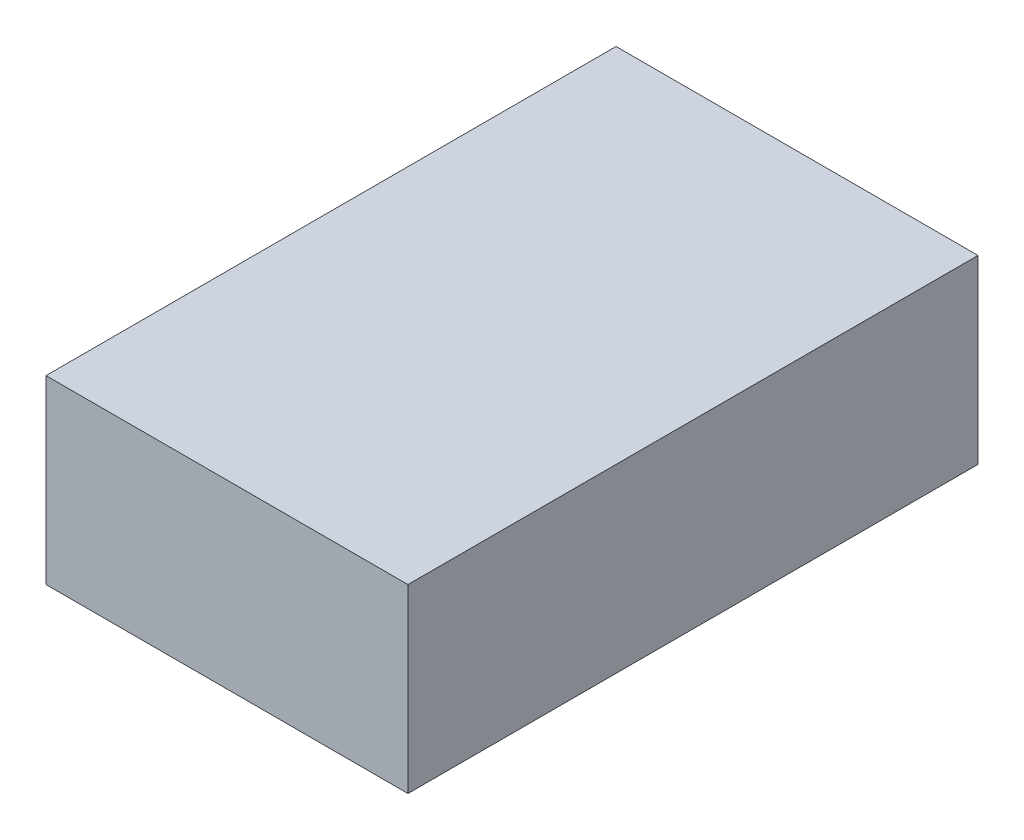
ISO-10303-21;
HEADER;
FILE_DESCRIPTION(('STEP AP214'),'2;1');
FILE_NAME('part.step','',(''),(''),'','','');
FILE_SCHEMA(('AUTOMOTIVE_DESIGN { 1 0 10303 214 1 1 1 1 }'));
ENDSEC;
DATA;
#1=APPLICATION_CONTEXT('core data for automotive mechanical design processes');
#2=APPLICATION_PROTOCOL_DEFINITION('international standard','automotive_design',2000,#1);
#3=PRODUCT_CONTEXT('',#1,'mechanical');
#4=PRODUCT('Part','Part','',(#3));
#5=PRODUCT_RELATED_PRODUCT_CATEGORY('part','',(#4));
#6=PRODUCT_DEFINITION_FORMATION('','',#4);
#7=PRODUCT_DEFINITION_CONTEXT('part definition',#1,'design');
#8=PRODUCT_DEFINITION('design','',#6,#7);
#9=PRODUCT_DEFINITION_SHAPE('','',#8);
#10=(LENGTH_UNIT() NAMED_UNIT(*) SI_UNIT(.MILLI.,.METRE.));
#11=(NAMED_UNIT(*) PLANE_ANGLE_UNIT() SI_UNIT($,.RADIAN.));
#12=(NAMED_UNIT(*) SI_UNIT($,.STERADIAN.) SOLID_ANGLE_UNIT());
#13=UNCERTAINTY_MEASURE_WITH_UNIT(LENGTH_MEASURE(1.E-05),#10,'distance_accuracy_value','');
#14=(GEOMETRIC_REPRESENTATION_CONTEXT(3) GLOBAL_UNCERTAINTY_ASSIGNED_CONTEXT((#13)) GLOBAL_UNIT_ASSIGNED_CONTEXT((#10,
#11,#12)) REPRESENTATION_CONTEXT('',''));
#15=CARTESIAN_POINT('',(0.,0.,0.));
#16=DIRECTION('',(0.,0.,1.));
#17=DIRECTION('',(1.,0.,0.));
#18=AXIS2_PLACEMENT_3D('',#15,#16,#17);
#19=CARTESIAN_POINT('',(0.,20.,63.));
#20=DIRECTION('',(1.,0.,0.));
#21=DIRECTION('',(0.,0.,-1.));
#22=AXIS2_PLACEMENT_3D('',#19,#20,#21);
#23=PLANE('',#22);
#24=DIRECTION('',(0.,0.,1.));
#25=VECTOR('',#24,1.);
#26=CARTESIAN_POINT('',(0.,0.,63.));
#27=LINE('',#26,#25);
#28=CARTESIAN_POINT('',(0.,0.,0.));
#29=VERTEX_POINT('',#28);
#30=CARTESIAN_POINT('',(0.,0.,63.));
#31=VERTEX_POINT('',#30);
#32=EDGE_CURVE('E107',#29,#31,#27,.T.);
#33=ORIENTED_EDGE('',*,*,#32,.T.);
#34=DIRECTION('',(0.,-1.,0.));
#35=VECTOR('',#34,1.);
#36=CARTESIAN_POINT('',(0.,20.,63.));
#37=LINE('',#36,#35);
#38=CARTESIAN_POINT('',(0.,20.,63.));
#39=VERTEX_POINT('',#38);
#40=EDGE_CURVE('E11',#39,#31,#37,.T.);
#41=ORIENTED_EDGE('',*,*,#40,.F.);
#42=DIRECTION('',(0.,0.,1.));
#43=VECTOR('',#42,1.);
#44=CARTESIAN_POINT('',(0.,20.,63.));
#45=LINE('',#44,#43);
#46=CARTESIAN_POINT('',(0.,20.,0.));
#47=VERTEX_POINT('',#46);
#48=EDGE_CURVE('E91',#47,#39,#45,.T.);
#49=ORIENTED_EDGE('',*,*,#48,.F.);
#50=DIRECTION('',(0.,-1.,0.));
#51=VECTOR('',#50,1.);
#52=CARTESIAN_POINT('',(0.,20.,0.));
#53=LINE('',#52,#51);
#54=EDGE_CURVE('E103',#47,#29,#53,.T.);
#55=ORIENTED_EDGE('',*,*,#54,.T.);
#56=EDGE_LOOP('',(#33,#41,#49,#55));
#57=FACE_BOUND('',#56,.T.);
#58=ADVANCED_FACE('F39',(#57),#23,.F.);
#59=CARTESIAN_POINT('',(40.,20.,63.));
#60=DIRECTION('',(0.,0.,-1.));
#61=DIRECTION('',(-1.,0.,0.));
#62=AXIS2_PLACEMENT_3D('',#59,#60,#61);
#63=PLANE('',#62);
#64=DIRECTION('',(1.,0.,0.));
#65=VECTOR('',#64,1.);
#66=CARTESIAN_POINT('',(40.,0.,63.));
#67=LINE('',#66,#65);
#68=CARTESIAN_POINT('',(40.,0.,63.));
#69=VERTEX_POINT('',#68);
#70=EDGE_CURVE('E96',#31,#69,#67,.T.);
#71=ORIENTED_EDGE('',*,*,#70,.T.);
#72=DIRECTION('',(0.,-1.,0.));
#73=VECTOR('',#72,1.);
#74=CARTESIAN_POINT('',(40.,20.,63.));
#75=LINE('',#74,#73);
#76=CARTESIAN_POINT('',(40.,20.,63.));
#77=VERTEX_POINT('',#76);
#78=EDGE_CURVE('E48',#77,#69,#75,.T.);
#79=ORIENTED_EDGE('',*,*,#78,.F.);
#80=DIRECTION('',(1.,0.,0.));
#81=VECTOR('',#80,1.);
#82=CARTESIAN_POINT('',(40.,20.,63.));
#83=LINE('',#82,#81);
#84=EDGE_CURVE('E86',#39,#77,#83,.T.);
#85=ORIENTED_EDGE('',*,*,#84,.F.);
#86=ORIENTED_EDGE('',*,*,#40,.T.);
#87=EDGE_LOOP('',(#71,#79,#85,#86));
#88=FACE_BOUND('',#87,.T.);
#89=ADVANCED_FACE('F95',(#88),#63,.F.);
#90=CARTESIAN_POINT('',(40.,20.,0.));
#91=DIRECTION('',(-1.,0.,0.));
#92=DIRECTION('',(0.,0.,1.));
#93=AXIS2_PLACEMENT_3D('',#90,#91,#92);
#94=PLANE('',#93);
#95=DIRECTION('',(0.,0.,-1.));
#96=VECTOR('',#95,1.);
#97=CARTESIAN_POINT('',(40.,0.,0.));
#98=LINE('',#97,#96);
#99=CARTESIAN_POINT('',(40.,0.,0.));
#100=VERTEX_POINT('',#99);
#101=EDGE_CURVE('E73',#69,#100,#98,.T.);
#102=ORIENTED_EDGE('',*,*,#101,.T.);
#103=DIRECTION('',(0.,-1.,0.));
#104=VECTOR('',#103,1.);
#105=CARTESIAN_POINT('',(40.,20.,0.));
#106=LINE('',#105,#104);
#107=CARTESIAN_POINT('',(40.,20.,0.));
#108=VERTEX_POINT('',#107);
#109=EDGE_CURVE('E98',#108,#100,#106,.T.);
#110=ORIENTED_EDGE('',*,*,#109,.F.);
#111=DIRECTION('',(0.,0.,-1.));
#112=VECTOR('',#111,1.);
#113=CARTESIAN_POINT('',(40.,20.,0.));
#114=LINE('',#113,#112);
#115=EDGE_CURVE('E89',#77,#108,#114,.T.);
#116=ORIENTED_EDGE('',*,*,#115,.F.);
#117=ORIENTED_EDGE('',*,*,#78,.T.);
#118=EDGE_LOOP('',(#102,#110,#116,#117));
#119=FACE_BOUND('',#118,.T.);
#120=ADVANCED_FACE('F99',(#119),#94,.F.);
#121=CARTESIAN_POINT('',(0.,20.,0.));
#122=DIRECTION('',(0.,0.,1.));
#123=DIRECTION('',(1.,0.,0.));
#124=AXIS2_PLACEMENT_3D('',#121,#122,#123);
#125=PLANE('',#124);
#126=DIRECTION('',(-1.,0.,0.));
#127=VECTOR('',#126,1.);
#128=CARTESIAN_POINT('',(0.,0.,0.));
#129=LINE('',#128,#127);
#130=EDGE_CURVE('E79',#100,#29,#129,.T.);
#131=ORIENTED_EDGE('',*,*,#130,.T.);
#132=ORIENTED_EDGE('',*,*,#54,.F.);
#133=DIRECTION('',(-1.,0.,0.));
#134=VECTOR('',#133,1.);
#135=CARTESIAN_POINT('',(0.,20.,0.));
#136=LINE('',#135,#134);
#137=EDGE_CURVE('E56',#108,#47,#136,.T.);
#138=ORIENTED_EDGE('',*,*,#137,.F.);
#139=ORIENTED_EDGE('',*,*,#109,.T.);
#140=EDGE_LOOP('',(#131,#132,#138,#139));
#141=FACE_BOUND('',#140,.T.);
#142=ADVANCED_FACE('F120',(#141),#125,.F.);
#143=CARTESIAN_POINT('',(0.,20.,0.));
#144=DIRECTION('',(0.,-1.,0.));
#145=DIRECTION('',(0.,0.,-1.));
#146=AXIS2_PLACEMENT_3D('',#143,#144,#145);
#147=PLANE('',#146);
#148=ORIENTED_EDGE('',*,*,#48,.T.);
#149=ORIENTED_EDGE('',*,*,#84,.T.);
#150=ORIENTED_EDGE('',*,*,#115,.T.);
#151=ORIENTED_EDGE('',*,*,#137,.T.);
#152=EDGE_LOOP('',(#148,#149,#150,#151));
#153=FACE_BOUND('',#152,.T.);
#154=ADVANCED_FACE('F87',(#153),#147,.F.);
#155=CARTESIAN_POINT('',(0.,0.,0.));
#156=DIRECTION('',(0.,-1.,0.));
#157=DIRECTION('',(0.,0.,-1.));
#158=AXIS2_PLACEMENT_3D('',#155,#156,#157);
#159=PLANE('',#158);
#160=ORIENTED_EDGE('',*,*,#32,.F.);
#161=ORIENTED_EDGE('',*,*,#130,.F.);
#162=ORIENTED_EDGE('',*,*,#101,.F.);
#163=ORIENTED_EDGE('',*,*,#70,.F.);
#164=EDGE_LOOP('',(#160,#161,#162,#163));
#165=FACE_BOUND('',#164,.T.);
#166=ADVANCED_FACE('F123',(#165),#159,.T.);
#167=CLOSED_SHELL('',(#58,#89,#120,#142,#154,#166));
#168=MANIFOLD_SOLID_BREP('B2',#167);
#169=ADVANCED_BREP_SHAPE_REPRESENTATION('',(#18,#168),#14);
#170=SHAPE_DEFINITION_REPRESENTATION(#9,#169);
ENDSEC;
END-ISO-10303-21;
